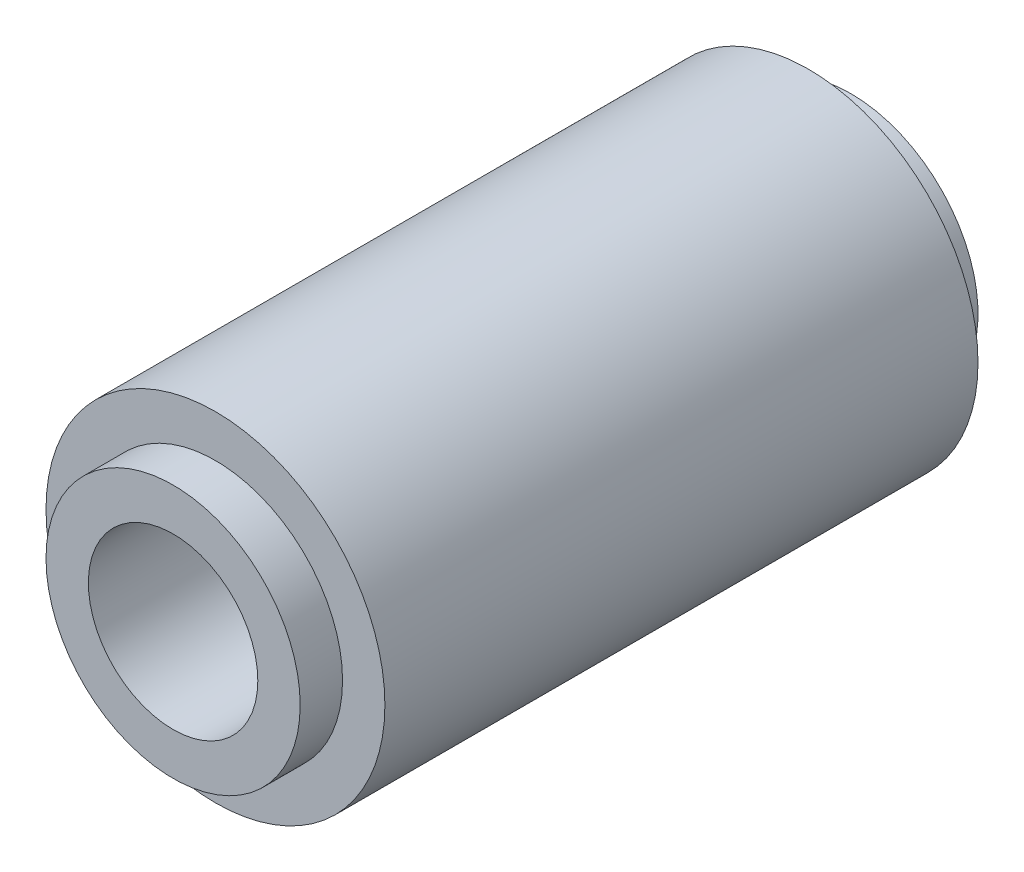
ISO-10303-21;
HEADER;
FILE_DESCRIPTION(('STEP AP214'),'2;1');
FILE_NAME('part.step','',(''),(''),'','','');
FILE_SCHEMA(('AUTOMOTIVE_DESIGN { 1 0 10303 214 1 1 1 1 }'));
ENDSEC;
DATA;
#1=APPLICATION_CONTEXT('core data for automotive mechanical design processes');
#2=APPLICATION_PROTOCOL_DEFINITION('international standard','automotive_design',2000,#1);
#3=PRODUCT_CONTEXT('',#1,'mechanical');
#4=PRODUCT('Part','Part','',(#3));
#5=PRODUCT_RELATED_PRODUCT_CATEGORY('part','',(#4));
#6=PRODUCT_DEFINITION_FORMATION('','',#4);
#7=PRODUCT_DEFINITION_CONTEXT('part definition',#1,'design');
#8=PRODUCT_DEFINITION('design','',#6,#7);
#9=PRODUCT_DEFINITION_SHAPE('','',#8);
#10=(LENGTH_UNIT() NAMED_UNIT(*) SI_UNIT(.MILLI.,.METRE.));
#11=(NAMED_UNIT(*) PLANE_ANGLE_UNIT() SI_UNIT($,.RADIAN.));
#12=(NAMED_UNIT(*) SI_UNIT($,.STERADIAN.) SOLID_ANGLE_UNIT());
#13=UNCERTAINTY_MEASURE_WITH_UNIT(LENGTH_MEASURE(1.E-05),#10,'distance_accuracy_value','');
#14=(GEOMETRIC_REPRESENTATION_CONTEXT(3) GLOBAL_UNCERTAINTY_ASSIGNED_CONTEXT((#13)) GLOBAL_UNIT_ASSIGNED_CONTEXT((#10,
#11,#12)) REPRESENTATION_CONTEXT('',''));
#15=CARTESIAN_POINT('',(0.,0.,0.));
#16=DIRECTION('',(0.,0.,1.));
#17=DIRECTION('',(1.,0.,0.));
#18=AXIS2_PLACEMENT_3D('',#15,#16,#17);
#19=CARTESIAN_POINT('',(0.,0.,-12.7));
#20=DIRECTION('',(0.,0.,-1.));
#21=DIRECTION('',(0.,-1.,0.));
#22=AXIS2_PLACEMENT_3D('',#19,#20,#21);
#23=CYLINDRICAL_SURFACE('',#22,4.7625);
#24=CARTESIAN_POINT('',(0.,0.,-11.1125));
#25=DIRECTION('',(0.,0.,1.));
#26=DIRECTION('',(1.,0.,0.));
#27=AXIS2_PLACEMENT_3D('',#24,#25,#26);
#28=CIRCLE('',#27,4.7625);
#29=CARTESIAN_POINT('',(4.7625,0.,-11.1125));
#30=VERTEX_POINT('',#29);
#31=EDGE_CURVE('E8',#30,#30,#28,.T.);
#32=ORIENTED_EDGE('',*,*,#31,.F.);
#33=EDGE_LOOP('',(#32));
#34=FACE_BOUND('',#33,.T.);
#35=CARTESIAN_POINT('',(0.,0.,-12.7));
#36=DIRECTION('',(0.,0.,-1.));
#37=DIRECTION('',(0.,-1.,0.));
#38=AXIS2_PLACEMENT_3D('',#35,#36,#37);
#39=CIRCLE('',#38,4.7625);
#40=CARTESIAN_POINT('',(0.,-4.7625,-12.7));
#41=VERTEX_POINT('',#40);
#42=EDGE_CURVE('E26',#41,#41,#39,.T.);
#43=ORIENTED_EDGE('',*,*,#42,.F.);
#44=EDGE_LOOP('',(#43));
#45=FACE_BOUND('',#44,.T.);
#46=ADVANCED_FACE('F13',(#34,#45),#23,.T.);
#47=CARTESIAN_POINT('',(0.,0.,-11.1125));
#48=DIRECTION('',(0.,0.,1.));
#49=DIRECTION('',(1.,0.,0.));
#50=AXIS2_PLACEMENT_3D('',#47,#48,#49);
#51=PLANE('',#50);
#52=ORIENTED_EDGE('',*,*,#31,.T.);
#53=EDGE_LOOP('',(#52));
#54=FACE_BOUND('',#53,.T.);
#55=CARTESIAN_POINT('',(0.,0.,-11.1125));
#56=DIRECTION('',(0.,0.,1.));
#57=DIRECTION('',(1.,0.,0.));
#58=AXIS2_PLACEMENT_3D('',#55,#56,#57);
#59=CIRCLE('',#58,6.35);
#60=CARTESIAN_POINT('',(6.35,0.,-11.1125));
#61=VERTEX_POINT('',#60);
#62=EDGE_CURVE('E32',#61,#61,#59,.T.);
#63=ORIENTED_EDGE('',*,*,#62,.F.);
#64=EDGE_LOOP('',(#63));
#65=FACE_BOUND('',#64,.T.);
#66=ADVANCED_FACE('F66',(#54,#65),#51,.F.);
#67=CARTESIAN_POINT('',(0.,0.,12.7));
#68=DIRECTION('',(0.,0.,-1.));
#69=DIRECTION('',(0.,-1.,0.));
#70=AXIS2_PLACEMENT_3D('',#67,#68,#69);
#71=CYLINDRICAL_SURFACE('',#70,4.7625);
#72=CARTESIAN_POINT('',(0.,0.,11.1125));
#73=DIRECTION('',(0.,0.,1.));
#74=DIRECTION('',(1.,0.,0.));
#75=AXIS2_PLACEMENT_3D('',#72,#73,#74);
#76=CIRCLE('',#75,4.7625);
#77=CARTESIAN_POINT('',(4.7625,0.,11.1125));
#78=VERTEX_POINT('',#77);
#79=EDGE_CURVE('E21',#78,#78,#76,.T.);
#80=ORIENTED_EDGE('',*,*,#79,.T.);
#81=EDGE_LOOP('',(#80));
#82=FACE_BOUND('',#81,.T.);
#83=CARTESIAN_POINT('',(0.,0.,12.7));
#84=DIRECTION('',(0.,0.,1.));
#85=DIRECTION('',(1.,0.,0.));
#86=AXIS2_PLACEMENT_3D('',#83,#84,#85);
#87=CIRCLE('',#86,4.7625);
#88=CARTESIAN_POINT('',(4.7625,0.,12.7));
#89=VERTEX_POINT('',#88);
#90=EDGE_CURVE('E36',#89,#89,#87,.T.);
#91=ORIENTED_EDGE('',*,*,#90,.F.);
#92=EDGE_LOOP('',(#91));
#93=FACE_BOUND('',#92,.T.);
#94=ADVANCED_FACE('F15',(#82,#93),#71,.T.);
#95=CARTESIAN_POINT('',(0.,0.,11.1125));
#96=DIRECTION('',(0.,0.,-1.));
#97=DIRECTION('',(-1.,0.,0.));
#98=AXIS2_PLACEMENT_3D('',#95,#96,#97);
#99=PLANE('',#98);
#100=ORIENTED_EDGE('',*,*,#79,.F.);
#101=EDGE_LOOP('',(#100));
#102=FACE_BOUND('',#101,.T.);
#103=CARTESIAN_POINT('',(0.,0.,11.1125));
#104=DIRECTION('',(0.,0.,-1.));
#105=DIRECTION('',(0.,-1.,0.));
#106=AXIS2_PLACEMENT_3D('',#103,#104,#105);
#107=CIRCLE('',#106,6.35);
#108=CARTESIAN_POINT('',(0.,-6.35,11.1125));
#109=VERTEX_POINT('',#108);
#110=EDGE_CURVE('E34',#109,#109,#107,.T.);
#111=ORIENTED_EDGE('',*,*,#110,.F.);
#112=EDGE_LOOP('',(#111));
#113=FACE_BOUND('',#112,.T.);
#114=ADVANCED_FACE('F48',(#102,#113),#99,.F.);
#115=CARTESIAN_POINT('',(0.,0.,0.));
#116=DIRECTION('',(0.,0.,1.));
#117=DIRECTION('',(1.,0.,0.));
#118=AXIS2_PLACEMENT_3D('',#115,#116,#117);
#119=CYLINDRICAL_SURFACE('',#118,3.175);
#120=CARTESIAN_POINT('',(0.,0.,-12.7));
#121=DIRECTION('',(0.,0.,1.));
#122=DIRECTION('',(1.,0.,0.));
#123=AXIS2_PLACEMENT_3D('',#120,#121,#122);
#124=CIRCLE('',#123,3.175);
#125=CARTESIAN_POINT('',(3.175,0.,-12.7));
#126=VERTEX_POINT('',#125);
#127=EDGE_CURVE('E31',#126,#126,#124,.T.);
#128=ORIENTED_EDGE('',*,*,#127,.F.);
#129=EDGE_LOOP('',(#128));
#130=FACE_BOUND('',#129,.T.);
#131=CARTESIAN_POINT('',(0.,0.,12.7));
#132=DIRECTION('',(0.,0.,-1.));
#133=DIRECTION('',(0.,-1.,0.));
#134=AXIS2_PLACEMENT_3D('',#131,#132,#133);
#135=CIRCLE('',#134,3.175);
#136=CARTESIAN_POINT('',(0.,-3.175,12.7));
#137=VERTEX_POINT('',#136);
#138=EDGE_CURVE('E17',#137,#137,#135,.T.);
#139=ORIENTED_EDGE('',*,*,#138,.F.);
#140=EDGE_LOOP('',(#139));
#141=FACE_BOUND('',#140,.T.);
#142=ADVANCED_FACE('F45',(#130,#141),#119,.F.);
#143=CARTESIAN_POINT('',(0.,0.,-12.7));
#144=DIRECTION('',(0.,0.,-1.));
#145=DIRECTION('',(-1.,0.,0.));
#146=AXIS2_PLACEMENT_3D('',#143,#144,#145);
#147=PLANE('',#146);
#148=ORIENTED_EDGE('',*,*,#42,.T.);
#149=EDGE_LOOP('',(#148));
#150=FACE_BOUND('',#149,.T.);
#151=ORIENTED_EDGE('',*,*,#127,.T.);
#152=EDGE_LOOP('',(#151));
#153=FACE_BOUND('',#152,.T.);
#154=ADVANCED_FACE('F43',(#150,#153),#147,.T.);
#155=CARTESIAN_POINT('',(0.,0.,0.));
#156=DIRECTION('',(0.,0.,1.));
#157=DIRECTION('',(1.,0.,0.));
#158=AXIS2_PLACEMENT_3D('',#155,#156,#157);
#159=CYLINDRICAL_SURFACE('',#158,6.35);
#160=ORIENTED_EDGE('',*,*,#62,.T.);
#161=EDGE_LOOP('',(#160));
#162=FACE_BOUND('',#161,.T.);
#163=ORIENTED_EDGE('',*,*,#110,.T.);
#164=EDGE_LOOP('',(#163));
#165=FACE_BOUND('',#164,.T.);
#166=ADVANCED_FACE('F55',(#162,#165),#159,.T.);
#167=CARTESIAN_POINT('',(0.,0.,12.7));
#168=DIRECTION('',(0.,0.,-1.));
#169=DIRECTION('',(-1.,0.,0.));
#170=AXIS2_PLACEMENT_3D('',#167,#168,#169);
#171=PLANE('',#170);
#172=ORIENTED_EDGE('',*,*,#90,.T.);
#173=EDGE_LOOP('',(#172));
#174=FACE_BOUND('',#173,.T.);
#175=ORIENTED_EDGE('',*,*,#138,.T.);
#176=EDGE_LOOP('',(#175));
#177=FACE_BOUND('',#176,.T.);
#178=ADVANCED_FACE('F53',(#174,#177),#171,.F.);
#179=CLOSED_SHELL('',(#46,#66,#94,#114,#142,#154,#166,#178));
#180=MANIFOLD_SOLID_BREP('B1',#179);
#181=ADVANCED_BREP_SHAPE_REPRESENTATION('',(#18,#180),#14);
#182=SHAPE_DEFINITION_REPRESENTATION(#9,#181);
ENDSEC;
END-ISO-10303-21;
